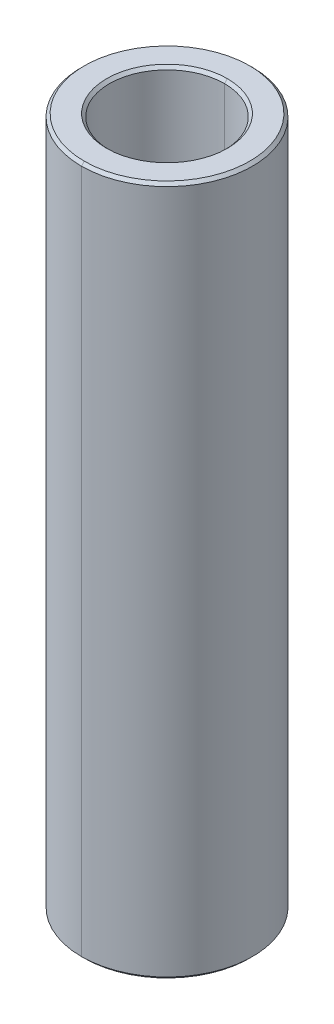
ISO-10303-21;
HEADER;
FILE_DESCRIPTION(('STEP AP214'),'2;1');
FILE_NAME('part.step','',(''),(''),'','','');
FILE_SCHEMA(('AUTOMOTIVE_DESIGN { 1 0 10303 214 1 1 1 1 }'));
ENDSEC;
DATA;
#1=APPLICATION_CONTEXT('core data for automotive mechanical design processes');
#2=APPLICATION_PROTOCOL_DEFINITION('international standard','automotive_design',2000,#1);
#3=PRODUCT_CONTEXT('',#1,'mechanical');
#4=PRODUCT('Part','Part','',(#3));
#5=PRODUCT_RELATED_PRODUCT_CATEGORY('part','',(#4));
#6=PRODUCT_DEFINITION_FORMATION('','',#4);
#7=PRODUCT_DEFINITION_CONTEXT('part definition',#1,'design');
#8=PRODUCT_DEFINITION('design','',#6,#7);
#9=PRODUCT_DEFINITION_SHAPE('','',#8);
#10=(LENGTH_UNIT() NAMED_UNIT(*) SI_UNIT(.MILLI.,.METRE.));
#11=(NAMED_UNIT(*) PLANE_ANGLE_UNIT() SI_UNIT($,.RADIAN.));
#12=(NAMED_UNIT(*) SI_UNIT($,.STERADIAN.) SOLID_ANGLE_UNIT());
#13=UNCERTAINTY_MEASURE_WITH_UNIT(LENGTH_MEASURE(1.E-05),#10,'distance_accuracy_value','');
#14=(GEOMETRIC_REPRESENTATION_CONTEXT(3) GLOBAL_UNCERTAINTY_ASSIGNED_CONTEXT((#13)) GLOBAL_UNIT_ASSIGNED_CONTEXT((#10,
#11,#12)) REPRESENTATION_CONTEXT('',''));
#15=CARTESIAN_POINT('',(0.,0.,0.));
#16=DIRECTION('',(0.,0.,1.));
#17=DIRECTION('',(1.,0.,0.));
#18=AXIS2_PLACEMENT_3D('',#15,#16,#17);
#19=CARTESIAN_POINT('',(0.,11.9,0.));
#20=DIRECTION('',(0.,1.,0.));
#21=DIRECTION('',(0.,0.,1.));
#22=AXIS2_PLACEMENT_3D('',#19,#20,#21);
#23=CONICAL_SURFACE('',#22,2.,0.785398163397448);
#24=DIRECTION('',(0.,0.707106781186548,-0.707106781186548));
#25=VECTOR('',#24,1.);
#26=CARTESIAN_POINT('',(0.,11.9,-2.));
#27=LINE('',#26,#25);
#28=CARTESIAN_POINT('',(0.,11.9,-2.));
#29=VERTEX_POINT('',#28);
#30=CARTESIAN_POINT('',(0.,12.,-2.1));
#31=VERTEX_POINT('',#30);
#32=EDGE_CURVE('E150',#29,#31,#27,.T.);
#33=ORIENTED_EDGE('',*,*,#32,.F.);
#34=CARTESIAN_POINT('',(0.,11.9,0.));
#35=DIRECTION('',(0.,1.,0.));
#36=DIRECTION('',(0.,0.,1.));
#37=AXIS2_PLACEMENT_3D('',#34,#35,#36);
#38=CIRCLE('',#37,2.);
#39=CARTESIAN_POINT('',(0.,11.9,2.));
#40=VERTEX_POINT('',#39);
#41=EDGE_CURVE('E26',#40,#29,#38,.T.);
#42=ORIENTED_EDGE('',*,*,#41,.F.);
#43=DIRECTION('',(0.,0.707106781186548,0.707106781186548));
#44=VECTOR('',#43,1.);
#45=CARTESIAN_POINT('',(0.,11.9,2.));
#46=LINE('',#45,#44);
#47=CARTESIAN_POINT('',(0.,12.,2.1));
#48=VERTEX_POINT('',#47);
#49=EDGE_CURVE('E157',#40,#48,#46,.T.);
#50=ORIENTED_EDGE('',*,*,#49,.T.);
#51=CARTESIAN_POINT('',(0.,12.,0.));
#52=DIRECTION('',(0.,-1.,0.));
#53=DIRECTION('',(0.,0.,1.));
#54=AXIS2_PLACEMENT_3D('',#51,#52,#53);
#55=CIRCLE('',#54,2.1);
#56=EDGE_CURVE('E117',#31,#48,#55,.T.);
#57=ORIENTED_EDGE('',*,*,#56,.F.);
#58=EDGE_LOOP('',(#33,#42,#50,#57));
#59=FACE_BOUND('',#58,.T.);
#60=ADVANCED_FACE('F15',(#59),#23,.F.);
#61=CARTESIAN_POINT('',(0.,-12.,0.));
#62=DIRECTION('',(0.,-1.,0.));
#63=DIRECTION('',(0.,0.,-1.));
#64=AXIS2_PLACEMENT_3D('',#61,#62,#63);
#65=CONICAL_SURFACE('',#64,2.1,0.785398163397457);
#66=DIRECTION('',(0.,-0.707106781186542,0.707106781186554));
#67=VECTOR('',#66,1.);
#68=CARTESIAN_POINT('',(0.,-12.,2.1));
#69=LINE('',#68,#67);
#70=CARTESIAN_POINT('',(0.,-11.9,2.));
#71=VERTEX_POINT('',#70);
#72=CARTESIAN_POINT('',(0.,-12.,2.1));
#73=VERTEX_POINT('',#72);
#74=EDGE_CURVE('E168',#71,#73,#69,.T.);
#75=ORIENTED_EDGE('',*,*,#74,.F.);
#76=CARTESIAN_POINT('',(0.,-11.9,0.));
#77=DIRECTION('',(0.,-1.,0.));
#78=DIRECTION('',(0.,0.,1.));
#79=AXIS2_PLACEMENT_3D('',#76,#77,#78);
#80=CIRCLE('',#79,2.);
#81=CARTESIAN_POINT('',(0.,-11.9,-2.));
#82=VERTEX_POINT('',#81);
#83=EDGE_CURVE('E10',#82,#71,#80,.T.);
#84=ORIENTED_EDGE('',*,*,#83,.F.);
#85=DIRECTION('',(0.,-0.707106781186542,-0.707106781186554));
#86=VECTOR('',#85,1.);
#87=CARTESIAN_POINT('',(0.,-12.,-2.1));
#88=LINE('',#87,#86);
#89=CARTESIAN_POINT('',(0.,-12.,-2.1));
#90=VERTEX_POINT('',#89);
#91=EDGE_CURVE('E179',#82,#90,#88,.T.);
#92=ORIENTED_EDGE('',*,*,#91,.T.);
#93=CARTESIAN_POINT('',(0.,-12.,0.));
#94=DIRECTION('',(0.,1.,0.));
#95=DIRECTION('',(0.,0.,1.));
#96=AXIS2_PLACEMENT_3D('',#93,#94,#95);
#97=CIRCLE('',#96,2.1);
#98=EDGE_CURVE('E171',#73,#90,#97,.T.);
#99=ORIENTED_EDGE('',*,*,#98,.F.);
#100=EDGE_LOOP('',(#75,#84,#92,#99));
#101=FACE_BOUND('',#100,.T.);
#102=ADVANCED_FACE('F258',(#101),#65,.F.);
#103=CARTESIAN_POINT('',(0.,12.,0.));
#104=DIRECTION('',(0.,-1.,0.));
#105=DIRECTION('',(0.,0.,-1.));
#106=AXIS2_PLACEMENT_3D('',#103,#104,#105);
#107=CONICAL_SURFACE('',#106,2.875,0.78539816339744);
#108=DIRECTION('',(0.,-0.707106781186554,0.707106781186542));
#109=VECTOR('',#108,1.);
#110=CARTESIAN_POINT('',(0.,12.,2.875));
#111=LINE('',#110,#109);
#112=CARTESIAN_POINT('',(0.,12.,2.875));
#113=VERTEX_POINT('',#112);
#114=CARTESIAN_POINT('',(0.,11.9,2.975));
#115=VERTEX_POINT('',#114);
#116=EDGE_CURVE('E189',#113,#115,#111,.T.);
#117=ORIENTED_EDGE('',*,*,#116,.F.);
#118=CARTESIAN_POINT('',(0.,12.,0.));
#119=DIRECTION('',(0.,1.,0.));
#120=DIRECTION('',(0.,0.,1.));
#121=AXIS2_PLACEMENT_3D('',#118,#119,#120);
#122=CIRCLE('',#121,2.875);
#123=CARTESIAN_POINT('',(0.,12.,-2.875));
#124=VERTEX_POINT('',#123);
#125=EDGE_CURVE('E59',#124,#113,#122,.T.);
#126=ORIENTED_EDGE('',*,*,#125,.F.);
#127=DIRECTION('',(0.,-0.707106781186554,-0.707106781186542));
#128=VECTOR('',#127,1.);
#129=CARTESIAN_POINT('',(0.,12.,-2.875));
#130=LINE('',#129,#128);
#131=CARTESIAN_POINT('',(0.,11.9,-2.975));
#132=VERTEX_POINT('',#131);
#133=EDGE_CURVE('E188',#124,#132,#130,.T.);
#134=ORIENTED_EDGE('',*,*,#133,.T.);
#135=CARTESIAN_POINT('',(0.,11.9,0.));
#136=DIRECTION('',(0.,-1.,0.));
#137=DIRECTION('',(0.,0.,1.));
#138=AXIS2_PLACEMENT_3D('',#135,#136,#137);
#139=CIRCLE('',#138,2.975);
#140=EDGE_CURVE('E106',#115,#132,#139,.T.);
#141=ORIENTED_EDGE('',*,*,#140,.F.);
#142=EDGE_LOOP('',(#117,#126,#134,#141));
#143=FACE_BOUND('',#142,.T.);
#144=ADVANCED_FACE('F262',(#143),#107,.T.);
#145=CARTESIAN_POINT('',(0.,-11.9,0.));
#146=DIRECTION('',(0.,1.,0.));
#147=DIRECTION('',(0.,0.,1.));
#148=AXIS2_PLACEMENT_3D('',#145,#146,#147);
#149=CONICAL_SURFACE('',#148,2.975,0.785398163397448);
#150=DIRECTION('',(0.,0.707106781186548,-0.707106781186548));
#151=VECTOR('',#150,1.);
#152=CARTESIAN_POINT('',(0.,-11.9,-2.975));
#153=LINE('',#152,#151);
#154=CARTESIAN_POINT('',(0.,-12.,-2.875));
#155=VERTEX_POINT('',#154);
#156=CARTESIAN_POINT('',(0.,-11.9,-2.975));
#157=VERTEX_POINT('',#156);
#158=EDGE_CURVE('E192',#155,#157,#153,.T.);
#159=ORIENTED_EDGE('',*,*,#158,.F.);
#160=CARTESIAN_POINT('',(0.,-12.,0.));
#161=DIRECTION('',(0.,-1.,0.));
#162=DIRECTION('',(0.,0.,1.));
#163=AXIS2_PLACEMENT_3D('',#160,#161,#162);
#164=CIRCLE('',#163,2.875);
#165=CARTESIAN_POINT('',(0.,-12.,2.875));
#166=VERTEX_POINT('',#165);
#167=EDGE_CURVE('E97',#166,#155,#164,.T.);
#168=ORIENTED_EDGE('',*,*,#167,.F.);
#169=DIRECTION('',(0.,0.707106781186548,0.707106781186548));
#170=VECTOR('',#169,1.);
#171=CARTESIAN_POINT('',(0.,-11.9,2.975));
#172=LINE('',#171,#170);
#173=CARTESIAN_POINT('',(0.,-11.9,2.975));
#174=VERTEX_POINT('',#173);
#175=EDGE_CURVE('E19',#166,#174,#172,.T.);
#176=ORIENTED_EDGE('',*,*,#175,.T.);
#177=CARTESIAN_POINT('',(0.,-11.9,0.));
#178=DIRECTION('',(0.,1.,0.));
#179=DIRECTION('',(0.,0.,1.));
#180=AXIS2_PLACEMENT_3D('',#177,#178,#179);
#181=CIRCLE('',#180,2.975);
#182=EDGE_CURVE('E41',#157,#174,#181,.T.);
#183=ORIENTED_EDGE('',*,*,#182,.F.);
#184=EDGE_LOOP('',(#159,#168,#176,#183));
#185=FACE_BOUND('',#184,.T.);
#186=ADVANCED_FACE('F241',(#185),#149,.T.);
#187=CARTESIAN_POINT('',(0.,12.,0.));
#188=DIRECTION('',(0.,-1.,0.));
#189=DIRECTION('',(0.,0.,-1.));
#190=AXIS2_PLACEMENT_3D('',#187,#188,#189);
#191=CYLINDRICAL_SURFACE('',#190,2.);
#192=DIRECTION('',(0.,-1.,0.));
#193=VECTOR('',#192,1.);
#194=CARTESIAN_POINT('',(0.,12.,2.));
#195=LINE('',#194,#193);
#196=EDGE_CURVE('E134',#40,#71,#195,.T.);
#197=ORIENTED_EDGE('',*,*,#196,.F.);
#198=ORIENTED_EDGE('',*,*,#41,.T.);
#199=DIRECTION('',(0.,-1.,0.));
#200=VECTOR('',#199,1.);
#201=CARTESIAN_POINT('',(0.,12.,-2.));
#202=LINE('',#201,#200);
#203=EDGE_CURVE('E131',#29,#82,#202,.T.);
#204=ORIENTED_EDGE('',*,*,#203,.T.);
#205=ORIENTED_EDGE('',*,*,#83,.T.);
#206=EDGE_LOOP('',(#197,#198,#204,#205));
#207=FACE_BOUND('',#206,.T.);
#208=ADVANCED_FACE('F130',(#207),#191,.F.);
#209=CARTESIAN_POINT('',(0.,12.,0.));
#210=DIRECTION('',(0.,-1.,0.));
#211=DIRECTION('',(0.,0.,-1.));
#212=AXIS2_PLACEMENT_3D('',#209,#210,#211);
#213=CYLINDRICAL_SURFACE('',#212,2.975);
#214=DIRECTION('',(0.,-1.,0.));
#215=VECTOR('',#214,1.);
#216=CARTESIAN_POINT('',(0.,12.,2.975));
#217=LINE('',#216,#215);
#218=EDGE_CURVE('E147',#115,#174,#217,.T.);
#219=ORIENTED_EDGE('',*,*,#218,.F.);
#220=ORIENTED_EDGE('',*,*,#140,.T.);
#221=DIRECTION('',(0.,-1.,0.));
#222=VECTOR('',#221,1.);
#223=CARTESIAN_POINT('',(0.,12.,-2.975));
#224=LINE('',#223,#222);
#225=EDGE_CURVE('E172',#132,#157,#224,.T.);
#226=ORIENTED_EDGE('',*,*,#225,.T.);
#227=ORIENTED_EDGE('',*,*,#182,.T.);
#228=EDGE_LOOP('',(#219,#220,#226,#227));
#229=FACE_BOUND('',#228,.T.);
#230=ADVANCED_FACE('F17',(#229),#213,.T.);
#231=CARTESIAN_POINT('',(0.,-12.,0.));
#232=DIRECTION('',(0.,1.,0.));
#233=DIRECTION('',(1.,0.,0.));
#234=AXIS2_PLACEMENT_3D('',#231,#232,#233);
#235=PLANE('',#234);
#236=CARTESIAN_POINT('',(0.,-12.,0.));
#237=DIRECTION('',(0.,1.,0.));
#238=DIRECTION('',(0.,0.,1.));
#239=AXIS2_PLACEMENT_3D('',#236,#237,#238);
#240=CIRCLE('',#239,2.1);
#241=EDGE_CURVE('E175',#90,#73,#240,.T.);
#242=ORIENTED_EDGE('',*,*,#241,.T.);
#243=ORIENTED_EDGE('',*,*,#98,.T.);
#244=EDGE_LOOP('',(#242,#243));
#245=FACE_BOUND('',#244,.T.);
#246=ORIENTED_EDGE('',*,*,#167,.T.);
#247=CARTESIAN_POINT('',(0.,-12.,0.));
#248=DIRECTION('',(0.,-1.,0.));
#249=DIRECTION('',(0.,0.,1.));
#250=AXIS2_PLACEMENT_3D('',#247,#248,#249);
#251=CIRCLE('',#250,2.875);
#252=EDGE_CURVE('E191',#155,#166,#251,.T.);
#253=ORIENTED_EDGE('',*,*,#252,.T.);
#254=EDGE_LOOP('',(#246,#253));
#255=FACE_BOUND('',#254,.T.);
#256=ADVANCED_FACE('F247',(#245,#255),#235,.F.);
#257=CARTESIAN_POINT('',(0.,12.,0.));
#258=DIRECTION('',(0.,1.,0.));
#259=DIRECTION('',(1.,0.,0.));
#260=AXIS2_PLACEMENT_3D('',#257,#258,#259);
#261=PLANE('',#260);
#262=CARTESIAN_POINT('',(0.,12.,0.));
#263=DIRECTION('',(0.,-1.,0.));
#264=DIRECTION('',(0.,0.,1.));
#265=AXIS2_PLACEMENT_3D('',#262,#263,#264);
#266=CIRCLE('',#265,2.1);
#267=EDGE_CURVE('E154',#48,#31,#266,.T.);
#268=ORIENTED_EDGE('',*,*,#267,.T.);
#269=ORIENTED_EDGE('',*,*,#56,.T.);
#270=EDGE_LOOP('',(#268,#269));
#271=FACE_BOUND('',#270,.T.);
#272=ORIENTED_EDGE('',*,*,#125,.T.);
#273=CARTESIAN_POINT('',(0.,12.,0.));
#274=DIRECTION('',(0.,1.,0.));
#275=DIRECTION('',(0.,0.,1.));
#276=AXIS2_PLACEMENT_3D('',#273,#274,#275);
#277=CIRCLE('',#276,2.875);
#278=EDGE_CURVE('E183',#113,#124,#277,.T.);
#279=ORIENTED_EDGE('',*,*,#278,.T.);
#280=EDGE_LOOP('',(#272,#279));
#281=FACE_BOUND('',#280,.T.);
#282=ADVANCED_FACE('F253',(#271,#281),#261,.T.);
#283=CARTESIAN_POINT('',(0.,12.,0.));
#284=DIRECTION('',(0.,-1.,0.));
#285=DIRECTION('',(0.,0.,-1.));
#286=AXIS2_PLACEMENT_3D('',#283,#284,#285);
#287=CYLINDRICAL_SURFACE('',#286,2.975);
#288=CARTESIAN_POINT('',(0.,11.9,0.));
#289=DIRECTION('',(0.,-1.,0.));
#290=DIRECTION('',(0.,0.,1.));
#291=AXIS2_PLACEMENT_3D('',#288,#289,#290);
#292=CIRCLE('',#291,2.975);
#293=EDGE_CURVE('E184',#132,#115,#292,.T.);
#294=ORIENTED_EDGE('',*,*,#293,.T.);
#295=ORIENTED_EDGE('',*,*,#218,.T.);
#296=CARTESIAN_POINT('',(0.,-11.9,0.));
#297=DIRECTION('',(0.,1.,0.));
#298=DIRECTION('',(0.,0.,1.));
#299=AXIS2_PLACEMENT_3D('',#296,#297,#298);
#300=CIRCLE('',#299,2.975);
#301=EDGE_CURVE('E195',#174,#157,#300,.T.);
#302=ORIENTED_EDGE('',*,*,#301,.T.);
#303=ORIENTED_EDGE('',*,*,#225,.F.);
#304=EDGE_LOOP('',(#294,#295,#302,#303));
#305=FACE_BOUND('',#304,.T.);
#306=ADVANCED_FACE('F244',(#305),#287,.T.);
#307=CARTESIAN_POINT('',(0.,12.,0.));
#308=DIRECTION('',(0.,-1.,0.));
#309=DIRECTION('',(0.,0.,-1.));
#310=AXIS2_PLACEMENT_3D('',#307,#308,#309);
#311=CYLINDRICAL_SURFACE('',#310,2.);
#312=CARTESIAN_POINT('',(0.,11.9,0.));
#313=DIRECTION('',(0.,1.,0.));
#314=DIRECTION('',(0.,0.,1.));
#315=AXIS2_PLACEMENT_3D('',#312,#313,#314);
#316=CIRCLE('',#315,2.);
#317=EDGE_CURVE('E143',#29,#40,#316,.T.);
#318=ORIENTED_EDGE('',*,*,#317,.T.);
#319=ORIENTED_EDGE('',*,*,#196,.T.);
#320=CARTESIAN_POINT('',(0.,-11.9,0.));
#321=DIRECTION('',(0.,-1.,0.));
#322=DIRECTION('',(0.,0.,1.));
#323=AXIS2_PLACEMENT_3D('',#320,#321,#322);
#324=CIRCLE('',#323,2.);
#325=EDGE_CURVE('E145',#71,#82,#324,.T.);
#326=ORIENTED_EDGE('',*,*,#325,.T.);
#327=ORIENTED_EDGE('',*,*,#203,.F.);
#328=EDGE_LOOP('',(#318,#319,#326,#327));
#329=FACE_BOUND('',#328,.T.);
#330=ADVANCED_FACE('F141',(#329),#311,.F.);
#331=CARTESIAN_POINT('',(0.,-11.9,0.));
#332=DIRECTION('',(0.,1.,0.));
#333=DIRECTION('',(0.,0.,1.));
#334=AXIS2_PLACEMENT_3D('',#331,#332,#333);
#335=CONICAL_SURFACE('',#334,2.975,0.785398163397448);
#336=ORIENTED_EDGE('',*,*,#252,.F.);
#337=ORIENTED_EDGE('',*,*,#158,.T.);
#338=ORIENTED_EDGE('',*,*,#301,.F.);
#339=ORIENTED_EDGE('',*,*,#175,.F.);
#340=EDGE_LOOP('',(#336,#337,#338,#339));
#341=FACE_BOUND('',#340,.T.);
#342=ADVANCED_FACE('F242',(#341),#335,.T.);
#343=CARTESIAN_POINT('',(0.,12.,0.));
#344=DIRECTION('',(0.,-1.,0.));
#345=DIRECTION('',(0.,0.,-1.));
#346=AXIS2_PLACEMENT_3D('',#343,#344,#345);
#347=CONICAL_SURFACE('',#346,2.875,0.78539816339744);
#348=ORIENTED_EDGE('',*,*,#278,.F.);
#349=ORIENTED_EDGE('',*,*,#116,.T.);
#350=ORIENTED_EDGE('',*,*,#293,.F.);
#351=ORIENTED_EDGE('',*,*,#133,.F.);
#352=EDGE_LOOP('',(#348,#349,#350,#351));
#353=FACE_BOUND('',#352,.T.);
#354=ADVANCED_FACE('F268',(#353),#347,.T.);
#355=CARTESIAN_POINT('',(0.,-12.,0.));
#356=DIRECTION('',(0.,-1.,0.));
#357=DIRECTION('',(0.,0.,-1.));
#358=AXIS2_PLACEMENT_3D('',#355,#356,#357);
#359=CONICAL_SURFACE('',#358,2.1,0.785398163397457);
#360=ORIENTED_EDGE('',*,*,#325,.F.);
#361=ORIENTED_EDGE('',*,*,#74,.T.);
#362=ORIENTED_EDGE('',*,*,#241,.F.);
#363=ORIENTED_EDGE('',*,*,#91,.F.);
#364=EDGE_LOOP('',(#360,#361,#362,#363));
#365=FACE_BOUND('',#364,.T.);
#366=ADVANCED_FACE('F278',(#365),#359,.F.);
#367=CARTESIAN_POINT('',(0.,11.9,0.));
#368=DIRECTION('',(0.,1.,0.));
#369=DIRECTION('',(0.,0.,1.));
#370=AXIS2_PLACEMENT_3D('',#367,#368,#369);
#371=CONICAL_SURFACE('',#370,2.,0.785398163397448);
#372=ORIENTED_EDGE('',*,*,#317,.F.);
#373=ORIENTED_EDGE('',*,*,#32,.T.);
#374=ORIENTED_EDGE('',*,*,#267,.F.);
#375=ORIENTED_EDGE('',*,*,#49,.F.);
#376=EDGE_LOOP('',(#372,#373,#374,#375));
#377=FACE_BOUND('',#376,.T.);
#378=ADVANCED_FACE('F156',(#377),#371,.F.);
#379=CLOSED_SHELL('',(#60,#102,#144,#186,#208,#230,#256,#282,#306,#330,#342,#354,#366,#378));
#380=MANIFOLD_SOLID_BREP('B1',#379);
#381=ADVANCED_BREP_SHAPE_REPRESENTATION('',(#18,#380),#14);
#382=SHAPE_DEFINITION_REPRESENTATION(#9,#381);
ENDSEC;
END-ISO-10303-21;
